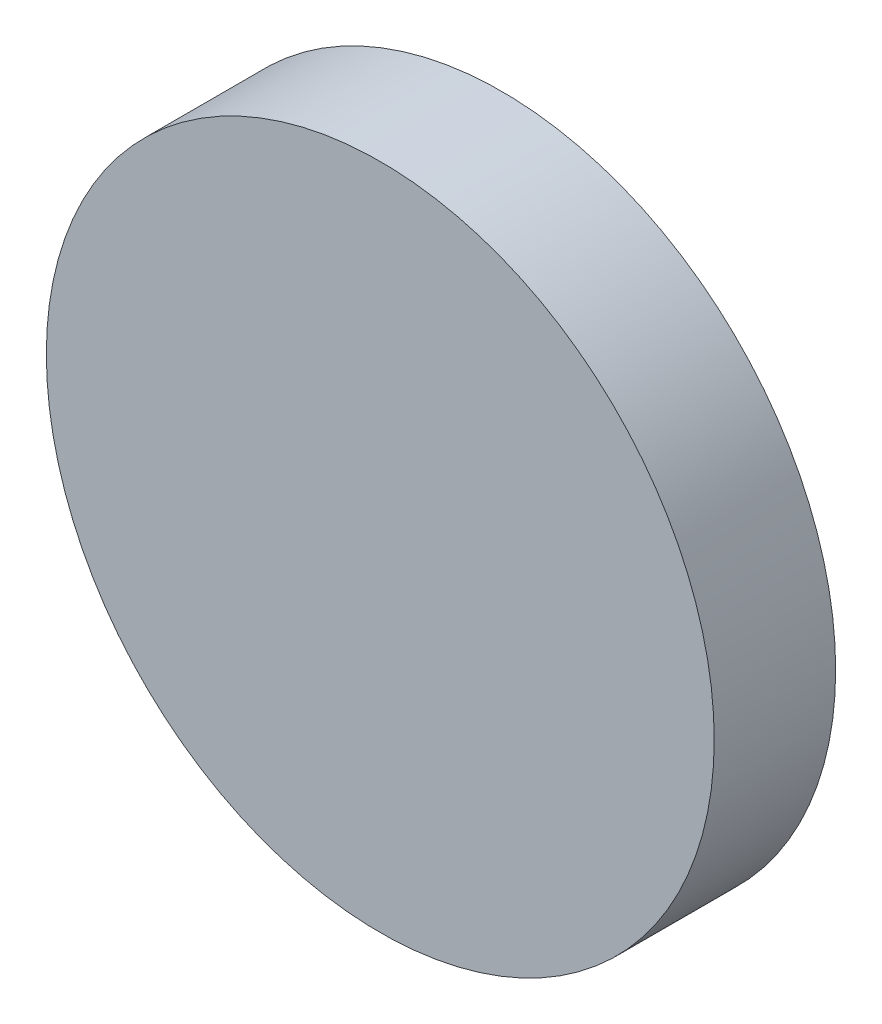
ISO-10303-21;
HEADER;
FILE_DESCRIPTION(('STEP AP214'),'2;1');
FILE_NAME('part.step','',(''),(''),'','','');
FILE_SCHEMA(('AUTOMOTIVE_DESIGN { 1 0 10303 214 1 1 1 1 }'));
ENDSEC;
DATA;
#1=APPLICATION_CONTEXT('core data for automotive mechanical design processes');
#2=APPLICATION_PROTOCOL_DEFINITION('international standard','automotive_design',2000,#1);
#3=PRODUCT_CONTEXT('',#1,'mechanical');
#4=PRODUCT('Part','Part','',(#3));
#5=PRODUCT_RELATED_PRODUCT_CATEGORY('part','',(#4));
#6=PRODUCT_DEFINITION_FORMATION('','',#4);
#7=PRODUCT_DEFINITION_CONTEXT('part definition',#1,'design');
#8=PRODUCT_DEFINITION('design','',#6,#7);
#9=PRODUCT_DEFINITION_SHAPE('','',#8);
#10=(LENGTH_UNIT() NAMED_UNIT(*) SI_UNIT(.MILLI.,.METRE.));
#11=(NAMED_UNIT(*) PLANE_ANGLE_UNIT() SI_UNIT($,.RADIAN.));
#12=(NAMED_UNIT(*) SI_UNIT($,.STERADIAN.) SOLID_ANGLE_UNIT());
#13=UNCERTAINTY_MEASURE_WITH_UNIT(LENGTH_MEASURE(1.E-05),#10,'distance_accuracy_value','');
#14=(GEOMETRIC_REPRESENTATION_CONTEXT(3) GLOBAL_UNCERTAINTY_ASSIGNED_CONTEXT((#13)) GLOBAL_UNIT_ASSIGNED_CONTEXT((#10,
#11,#12)) REPRESENTATION_CONTEXT('',''));
#15=CARTESIAN_POINT('',(0.,0.,0.));
#16=DIRECTION('',(0.,0.,1.));
#17=DIRECTION('',(1.,0.,0.));
#18=AXIS2_PLACEMENT_3D('',#15,#16,#17);
#19=CARTESIAN_POINT('',(0.,0.,25.4));
#20=DIRECTION('',(0.,0.,-1.));
#21=DIRECTION('',(-1.,0.,0.));
#22=AXIS2_PLACEMENT_3D('',#19,#20,#21);
#23=CYLINDRICAL_SURFACE('',#22,139.7);
#24=CARTESIAN_POINT('',(0.,0.,25.4));
#25=DIRECTION('',(0.,0.,1.));
#26=DIRECTION('',(1.,0.,0.));
#27=AXIS2_PLACEMENT_3D('',#24,#25,#26);
#28=CIRCLE('',#27,139.7);
#29=CARTESIAN_POINT('',(139.7,0.,25.4));
#30=VERTEX_POINT('',#29);
#31=EDGE_CURVE('E10',#30,#30,#28,.T.);
#32=ORIENTED_EDGE('',*,*,#31,.F.);
#33=EDGE_LOOP('',(#32));
#34=FACE_BOUND('',#33,.T.);
#35=CARTESIAN_POINT('',(0.,0.,-25.4));
#36=DIRECTION('',(0.,0.,1.));
#37=DIRECTION('',(1.,0.,0.));
#38=AXIS2_PLACEMENT_3D('',#35,#36,#37);
#39=CIRCLE('',#38,139.7);
#40=CARTESIAN_POINT('',(139.7,0.,-25.4));
#41=VERTEX_POINT('',#40);
#42=EDGE_CURVE('E36',#41,#41,#39,.T.);
#43=ORIENTED_EDGE('',*,*,#42,.T.);
#44=EDGE_LOOP('',(#43));
#45=FACE_BOUND('',#44,.T.);
#46=ADVANCED_FACE('F33',(#34,#45),#23,.T.);
#47=CARTESIAN_POINT('',(0.,0.,25.4));
#48=DIRECTION('',(0.,0.,1.));
#49=DIRECTION('',(1.,0.,0.));
#50=AXIS2_PLACEMENT_3D('',#47,#48,#49);
#51=PLANE('',#50);
#52=ORIENTED_EDGE('',*,*,#31,.T.);
#53=EDGE_LOOP('',(#52));
#54=FACE_BOUND('',#53,.T.);
#55=ADVANCED_FACE('F48',(#54),#51,.T.);
#56=CARTESIAN_POINT('',(0.,0.,-25.4));
#57=DIRECTION('',(0.,0.,1.));
#58=DIRECTION('',(1.,0.,0.));
#59=AXIS2_PLACEMENT_3D('',#56,#57,#58);
#60=PLANE('',#59);
#61=ORIENTED_EDGE('',*,*,#42,.F.);
#62=EDGE_LOOP('',(#61));
#63=FACE_BOUND('',#62,.T.);
#64=ADVANCED_FACE('F46',(#63),#60,.F.);
#65=CLOSED_SHELL('',(#46,#55,#64));
#66=MANIFOLD_SOLID_BREP('B2',#65);
#67=ADVANCED_BREP_SHAPE_REPRESENTATION('',(#18,#66),#14);
#68=SHAPE_DEFINITION_REPRESENTATION(#9,#67);
ENDSEC;
END-ISO-10303-21;
